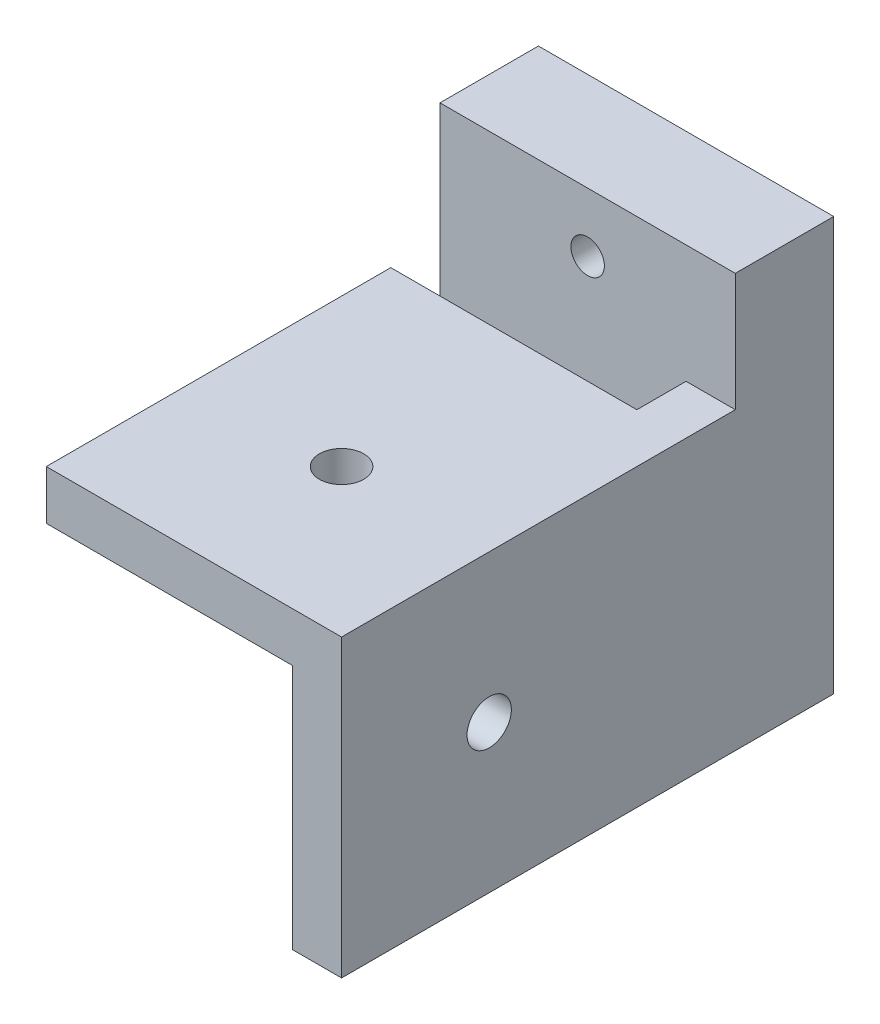
ISO-10303-21;
HEADER;
FILE_DESCRIPTION(('STEP AP214'),'2;1');
FILE_NAME('part.step','',(''),(''),'','','');
FILE_SCHEMA(('AUTOMOTIVE_DESIGN { 1 0 10303 214 1 1 1 1 }'));
ENDSEC;
DATA;
#1=APPLICATION_CONTEXT('core data for automotive mechanical design processes');
#2=APPLICATION_PROTOCOL_DEFINITION('international standard','automotive_design',2000,#1);
#3=PRODUCT_CONTEXT('',#1,'mechanical');
#4=PRODUCT('Part','Part','',(#3));
#5=PRODUCT_RELATED_PRODUCT_CATEGORY('part','',(#4));
#6=PRODUCT_DEFINITION_FORMATION('','',#4);
#7=PRODUCT_DEFINITION_CONTEXT('part definition',#1,'design');
#8=PRODUCT_DEFINITION('design','',#6,#7);
#9=PRODUCT_DEFINITION_SHAPE('','',#8);
#10=(LENGTH_UNIT() NAMED_UNIT(*) SI_UNIT(.MILLI.,.METRE.));
#11=(NAMED_UNIT(*) PLANE_ANGLE_UNIT() SI_UNIT($,.RADIAN.));
#12=(NAMED_UNIT(*) SI_UNIT($,.STERADIAN.) SOLID_ANGLE_UNIT());
#13=UNCERTAINTY_MEASURE_WITH_UNIT(LENGTH_MEASURE(1.E-05),#10,'distance_accuracy_value','');
#14=(GEOMETRIC_REPRESENTATION_CONTEXT(3) GLOBAL_UNCERTAINTY_ASSIGNED_CONTEXT((#13)) GLOBAL_UNIT_ASSIGNED_CONTEXT((#10,
#11,#12)) REPRESENTATION_CONTEXT('',''));
#15=CARTESIAN_POINT('',(0.,0.,0.));
#16=DIRECTION('',(0.,0.,1.));
#17=DIRECTION('',(1.,0.,0.));
#18=AXIS2_PLACEMENT_3D('',#15,#16,#17);
#19=CARTESIAN_POINT('',(0.,30.,50.));
#20=DIRECTION('',(0.,-1.,0.));
#21=DIRECTION('',(1.,0.,0.));
#22=AXIS2_PLACEMENT_3D('',#19,#20,#21);
#23=PLANE('',#22);
#24=CARTESIAN_POINT('',(-15.,30.,35.));
#25=DIRECTION('',(0.,-1.,0.));
#26=DIRECTION('',(0.,0.,-1.));
#27=AXIS2_PLACEMENT_3D('',#24,#25,#26);
#28=CIRCLE('',#27,2.25);
#29=CARTESIAN_POINT('',(-15.,30.,32.75));
#30=VERTEX_POINT('',#29);
#31=EDGE_CURVE('E190',#30,#30,#28,.T.);
#32=ORIENTED_EDGE('',*,*,#31,.T.);
#33=EDGE_LOOP('',(#32));
#34=FACE_BOUND('',#33,.T.);
#35=DIRECTION('',(1.,0.,0.));
#36=VECTOR('',#35,1.);
#37=CARTESIAN_POINT('',(-30.,30.,10.));
#38=LINE('',#37,#36);
#39=CARTESIAN_POINT('',(-5.,30.,10.));
#40=VERTEX_POINT('',#39);
#41=CARTESIAN_POINT('',(0.,30.,10.));
#42=VERTEX_POINT('',#41);
#43=EDGE_CURVE('E11',#40,#42,#38,.T.);
#44=ORIENTED_EDGE('',*,*,#43,.F.);
#45=DIRECTION('',(0.,0.,-1.));
#46=VECTOR('',#45,1.);
#47=CARTESIAN_POINT('',(-5.,30.,10.));
#48=LINE('',#47,#46);
#49=CARTESIAN_POINT('',(-5.,30.,15.));
#50=VERTEX_POINT('',#49);
#51=EDGE_CURVE('E231',#50,#40,#48,.T.);
#52=ORIENTED_EDGE('',*,*,#51,.F.);
#53=DIRECTION('',(1.,0.,0.));
#54=VECTOR('',#53,1.);
#55=CARTESIAN_POINT('',(-30.,30.,15.));
#56=LINE('',#55,#54);
#57=CARTESIAN_POINT('',(-30.,30.,15.));
#58=VERTEX_POINT('',#57);
#59=EDGE_CURVE('E220',#58,#50,#56,.T.);
#60=ORIENTED_EDGE('',*,*,#59,.F.);
#61=DIRECTION('',(0.,0.,-1.));
#62=VECTOR('',#61,1.);
#63=CARTESIAN_POINT('',(-30.,30.,50.));
#64=LINE('',#63,#62);
#65=CARTESIAN_POINT('',(-30.,30.,50.));
#66=VERTEX_POINT('',#65);
#67=EDGE_CURVE('E280',#66,#58,#64,.T.);
#68=ORIENTED_EDGE('',*,*,#67,.F.);
#69=DIRECTION('',(-1.,0.,0.));
#70=VECTOR('',#69,1.);
#71=CARTESIAN_POINT('',(0.,30.,50.));
#72=LINE('',#71,#70);
#73=CARTESIAN_POINT('',(0.,30.,50.));
#74=VERTEX_POINT('',#73);
#75=EDGE_CURVE('E255',#74,#66,#72,.T.);
#76=ORIENTED_EDGE('',*,*,#75,.F.);
#77=DIRECTION('',(0.,0.,-1.));
#78=VECTOR('',#77,1.);
#79=CARTESIAN_POINT('',(0.,30.,50.));
#80=LINE('',#79,#78);
#81=EDGE_CURVE('E50',#74,#42,#80,.T.);
#82=ORIENTED_EDGE('',*,*,#81,.T.);
#83=EDGE_LOOP('',(#44,#52,#60,#68,#76,#82));
#84=FACE_BOUND('',#83,.T.);
#85=ADVANCED_FACE('F40',(#34,#84),#23,.F.);
#86=CARTESIAN_POINT('',(-30.,0.,50.));
#87=DIRECTION('',(1.,0.,0.));
#88=DIRECTION('',(0.,0.,-1.));
#89=AXIS2_PLACEMENT_3D('',#86,#87,#88);
#90=PLANE('',#89);
#91=DIRECTION('',(0.,0.,-1.));
#92=VECTOR('',#91,1.);
#93=CARTESIAN_POINT('',(-30.,0.,50.));
#94=LINE('',#93,#92);
#95=CARTESIAN_POINT('',(-30.,0.,10.));
#96=VERTEX_POINT('',#95);
#97=CARTESIAN_POINT('',(-30.,0.,0.));
#98=VERTEX_POINT('',#97);
#99=EDGE_CURVE('E139',#96,#98,#94,.T.);
#100=ORIENTED_EDGE('',*,*,#99,.F.);
#101=DIRECTION('',(0.,1.,0.));
#102=VECTOR('',#101,1.);
#103=CARTESIAN_POINT('',(-30.,0.,10.));
#104=LINE('',#103,#102);
#105=CARTESIAN_POINT('',(-30.,42.,10.));
#106=VERTEX_POINT('',#105);
#107=EDGE_CURVE('E133',#96,#106,#104,.T.);
#108=ORIENTED_EDGE('',*,*,#107,.T.);
#109=DIRECTION('',(0.,0.,1.));
#110=VECTOR('',#109,1.);
#111=CARTESIAN_POINT('',(-30.,42.,0.));
#112=LINE('',#111,#110);
#113=CARTESIAN_POINT('',(-30.,42.,0.));
#114=VERTEX_POINT('',#113);
#115=EDGE_CURVE('E138',#114,#106,#112,.T.);
#116=ORIENTED_EDGE('',*,*,#115,.F.);
#117=DIRECTION('',(0.,-1.,0.));
#118=VECTOR('',#117,1.);
#119=CARTESIAN_POINT('',(-30.,0.,0.));
#120=LINE('',#119,#118);
#121=EDGE_CURVE('E269',#114,#98,#120,.T.);
#122=ORIENTED_EDGE('',*,*,#121,.T.);
#123=EDGE_LOOP('',(#100,#108,#116,#122));
#124=FACE_BOUND('',#123,.T.);
#125=ADVANCED_FACE('F135',(#124),#90,.F.);
#126=CARTESIAN_POINT('',(0.,0.,50.));
#127=DIRECTION('',(-1.,0.,0.));
#128=DIRECTION('',(0.,0.,1.));
#129=AXIS2_PLACEMENT_3D('',#126,#127,#128);
#130=PLANE('',#129);
#131=CARTESIAN_POINT('',(0.,15.,35.));
#132=DIRECTION('',(-1.,0.,0.));
#133=DIRECTION('',(0.,0.,1.));
#134=AXIS2_PLACEMENT_3D('',#131,#132,#133);
#135=CIRCLE('',#134,2.25);
#136=CARTESIAN_POINT('',(0.,15.,37.25));
#137=VERTEX_POINT('',#136);
#138=EDGE_CURVE('E182',#137,#137,#135,.T.);
#139=ORIENTED_EDGE('',*,*,#138,.T.);
#140=EDGE_LOOP('',(#139));
#141=FACE_BOUND('',#140,.T.);
#142=DIRECTION('',(0.,1.,0.));
#143=VECTOR('',#142,1.);
#144=CARTESIAN_POINT('',(0.,0.,0.));
#145=LINE('',#144,#143);
#146=CARTESIAN_POINT('',(0.,0.,0.));
#147=VERTEX_POINT('',#146);
#148=CARTESIAN_POINT('',(0.,42.,0.));
#149=VERTEX_POINT('',#148);
#150=EDGE_CURVE('E144',#147,#149,#145,.T.);
#151=ORIENTED_EDGE('',*,*,#150,.T.);
#152=DIRECTION('',(0.,0.,-1.));
#153=VECTOR('',#152,1.);
#154=CARTESIAN_POINT('',(0.,42.,0.));
#155=LINE('',#154,#153);
#156=CARTESIAN_POINT('',(0.,42.,10.));
#157=VERTEX_POINT('',#156);
#158=EDGE_CURVE('E157',#157,#149,#155,.T.);
#159=ORIENTED_EDGE('',*,*,#158,.F.);
#160=DIRECTION('',(0.,-1.,0.));
#161=VECTOR('',#160,1.);
#162=CARTESIAN_POINT('',(0.,42.,10.));
#163=LINE('',#162,#161);
#164=EDGE_CURVE('E152',#157,#42,#163,.T.);
#165=ORIENTED_EDGE('',*,*,#164,.T.);
#166=ORIENTED_EDGE('',*,*,#81,.F.);
#167=DIRECTION('',(0.,1.,0.));
#168=VECTOR('',#167,1.);
#169=CARTESIAN_POINT('',(0.,0.,50.));
#170=LINE('',#169,#168);
#171=CARTESIAN_POINT('',(0.,0.,50.));
#172=VERTEX_POINT('',#171);
#173=EDGE_CURVE('E251',#172,#74,#170,.T.);
#174=ORIENTED_EDGE('',*,*,#173,.F.);
#175=DIRECTION('',(0.,0.,-1.));
#176=VECTOR('',#175,1.);
#177=CARTESIAN_POINT('',(0.,0.,50.));
#178=LINE('',#177,#176);
#179=EDGE_CURVE('E266',#172,#147,#178,.T.);
#180=ORIENTED_EDGE('',*,*,#179,.T.);
#181=EDGE_LOOP('',(#151,#159,#165,#166,#174,#180));
#182=FACE_BOUND('',#181,.T.);
#183=ADVANCED_FACE('F42',(#141,#182),#130,.F.);
#184=CARTESIAN_POINT('',(-30.,0.,25.));
#185=VERTEX_POINT('',#184);
#186=CARTESIAN_POINT('',(-30.,0.,15.));
#187=VERTEX_POINT('',#186);
#188=EDGE_CURVE('E277',#185,#187,#94,.T.);
#189=ORIENTED_EDGE('',*,*,#188,.F.);
#190=DIRECTION('',(0.,1.,0.));
#191=VECTOR('',#190,1.);
#192=CARTESIAN_POINT('',(-30.,0.,25.));
#193=LINE('',#192,#191);
#194=CARTESIAN_POINT('',(-30.,25.,25.));
#195=VERTEX_POINT('',#194);
#196=EDGE_CURVE('E221',#185,#195,#193,.T.);
#197=ORIENTED_EDGE('',*,*,#196,.T.);
#198=DIRECTION('',(0.,0.,1.));
#199=VECTOR('',#198,1.);
#200=CARTESIAN_POINT('',(-30.,25.,25.));
#201=LINE('',#200,#199);
#202=CARTESIAN_POINT('',(-30.,25.,50.));
#203=VERTEX_POINT('',#202);
#204=EDGE_CURVE('E210',#195,#203,#201,.T.);
#205=ORIENTED_EDGE('',*,*,#204,.T.);
#206=DIRECTION('',(0.,-1.,0.));
#207=VECTOR('',#206,1.);
#208=CARTESIAN_POINT('',(-30.,0.,50.));
#209=LINE('',#208,#207);
#210=EDGE_CURVE('E259',#66,#203,#209,.T.);
#211=ORIENTED_EDGE('',*,*,#210,.F.);
#212=ORIENTED_EDGE('',*,*,#67,.T.);
#213=DIRECTION('',(0.,1.,0.));
#214=VECTOR('',#213,1.);
#215=CARTESIAN_POINT('',(-30.,0.,15.));
#216=LINE('',#215,#214);
#217=EDGE_CURVE('E237',#187,#58,#216,.T.);
#218=ORIENTED_EDGE('',*,*,#217,.F.);
#219=EDGE_LOOP('',(#189,#197,#205,#211,#212,#218));
#220=FACE_BOUND('',#219,.T.);
#221=ADVANCED_FACE('F309',(#220),#90,.F.);
#222=CARTESIAN_POINT('',(0.,0.,50.));
#223=DIRECTION('',(0.,1.,0.));
#224=DIRECTION('',(-1.,0.,0.));
#225=AXIS2_PLACEMENT_3D('',#222,#223,#224);
#226=PLANE('',#225);
#227=DIRECTION('',(1.,0.,0.));
#228=VECTOR('',#227,1.);
#229=CARTESIAN_POINT('',(0.,0.,50.));
#230=LINE('',#229,#228);
#231=CARTESIAN_POINT('',(-5.,0.,50.));
#232=VERTEX_POINT('',#231);
#233=EDGE_CURVE('E263',#232,#172,#230,.T.);
#234=ORIENTED_EDGE('',*,*,#233,.F.);
#235=DIRECTION('',(0.,0.,-1.));
#236=VECTOR('',#235,1.);
#237=CARTESIAN_POINT('',(-5.,0.,25.));
#238=LINE('',#237,#236);
#239=CARTESIAN_POINT('',(-5.,0.,25.));
#240=VERTEX_POINT('',#239);
#241=EDGE_CURVE('E194',#232,#240,#238,.T.);
#242=ORIENTED_EDGE('',*,*,#241,.T.);
#243=DIRECTION('',(-1.,0.,0.));
#244=VECTOR('',#243,1.);
#245=CARTESIAN_POINT('',(-5.,0.,25.));
#246=LINE('',#245,#244);
#247=EDGE_CURVE('E198',#240,#185,#246,.T.);
#248=ORIENTED_EDGE('',*,*,#247,.T.);
#249=ORIENTED_EDGE('',*,*,#188,.T.);
#250=DIRECTION('',(1.,0.,0.));
#251=VECTOR('',#250,1.);
#252=CARTESIAN_POINT('',(-30.,0.,15.));
#253=LINE('',#252,#251);
#254=CARTESIAN_POINT('',(-5.,0.,15.));
#255=VERTEX_POINT('',#254);
#256=EDGE_CURVE('E227',#187,#255,#253,.T.);
#257=ORIENTED_EDGE('',*,*,#256,.T.);
#258=DIRECTION('',(0.,0.,-1.));
#259=VECTOR('',#258,1.);
#260=CARTESIAN_POINT('',(-5.,0.,10.));
#261=LINE('',#260,#259);
#262=CARTESIAN_POINT('',(-5.,0.,10.));
#263=VERTEX_POINT('',#262);
#264=EDGE_CURVE('E66',#255,#263,#261,.T.);
#265=ORIENTED_EDGE('',*,*,#264,.T.);
#266=DIRECTION('',(-1.,0.,0.));
#267=VECTOR('',#266,1.);
#268=CARTESIAN_POINT('',(-30.,0.,10.));
#269=LINE('',#268,#267);
#270=EDGE_CURVE('E234',#263,#96,#269,.T.);
#271=ORIENTED_EDGE('',*,*,#270,.T.);
#272=ORIENTED_EDGE('',*,*,#99,.T.);
#273=DIRECTION('',(1.,0.,0.));
#274=VECTOR('',#273,1.);
#275=CARTESIAN_POINT('',(0.,0.,0.));
#276=LINE('',#275,#274);
#277=EDGE_CURVE('E256',#98,#147,#276,.T.);
#278=ORIENTED_EDGE('',*,*,#277,.T.);
#279=ORIENTED_EDGE('',*,*,#179,.F.);
#280=EDGE_LOOP('',(#234,#242,#248,#249,#257,#265,#271,#272,#278,#279));
#281=FACE_BOUND('',#280,.T.);
#282=ADVANCED_FACE('F298',(#281),#226,.F.);
#283=CARTESIAN_POINT('',(0.,0.,50.));
#284=DIRECTION('',(0.,0.,1.));
#285=DIRECTION('',(1.,0.,0.));
#286=AXIS2_PLACEMENT_3D('',#283,#284,#285);
#287=PLANE('',#286);
#288=DIRECTION('',(0.,1.,0.));
#289=VECTOR('',#288,1.);
#290=CARTESIAN_POINT('',(-5.,0.,50.));
#291=LINE('',#290,#289);
#292=CARTESIAN_POINT('',(-5.,25.,50.));
#293=VERTEX_POINT('',#292);
#294=EDGE_CURVE('E217',#232,#293,#291,.T.);
#295=ORIENTED_EDGE('',*,*,#294,.F.);
#296=ORIENTED_EDGE('',*,*,#233,.T.);
#297=ORIENTED_EDGE('',*,*,#173,.T.);
#298=ORIENTED_EDGE('',*,*,#75,.T.);
#299=ORIENTED_EDGE('',*,*,#210,.T.);
#300=DIRECTION('',(1.,0.,0.));
#301=VECTOR('',#300,1.);
#302=CARTESIAN_POINT('',(-5.,25.,50.));
#303=LINE('',#302,#301);
#304=EDGE_CURVE('E199',#203,#293,#303,.T.);
#305=ORIENTED_EDGE('',*,*,#304,.T.);
#306=EDGE_LOOP('',(#295,#296,#297,#298,#299,#305));
#307=FACE_BOUND('',#306,.T.);
#308=ADVANCED_FACE('F301',(#307),#287,.T.);
#309=CARTESIAN_POINT('',(0.,0.,0.));
#310=DIRECTION('',(0.,0.,1.));
#311=DIRECTION('',(1.,0.,0.));
#312=AXIS2_PLACEMENT_3D('',#309,#310,#311);
#313=PLANE('',#312);
#314=CARTESIAN_POINT('',(-15.,36.,0.));
#315=DIRECTION('',(0.,0.,-1.));
#316=DIRECTION('',(-1.,0.,0.));
#317=AXIS2_PLACEMENT_3D('',#314,#315,#316);
#318=CIRCLE('',#317,3.5);
#319=CARTESIAN_POINT('',(-18.5,36.,0.));
#320=VERTEX_POINT('',#319);
#321=EDGE_CURVE('E387',#320,#320,#318,.T.);
#322=ORIENTED_EDGE('',*,*,#321,.F.);
#323=EDGE_LOOP('',(#322));
#324=FACE_BOUND('',#323,.T.);
#325=ORIENTED_EDGE('',*,*,#150,.F.);
#326=ORIENTED_EDGE('',*,*,#277,.F.);
#327=ORIENTED_EDGE('',*,*,#121,.F.);
#328=DIRECTION('',(-1.,0.,0.));
#329=VECTOR('',#328,1.);
#330=CARTESIAN_POINT('',(-30.,42.,0.));
#331=LINE('',#330,#329);
#332=EDGE_CURVE('E162',#149,#114,#331,.T.);
#333=ORIENTED_EDGE('',*,*,#332,.F.);
#334=EDGE_LOOP('',(#325,#326,#327,#333));
#335=FACE_BOUND('',#334,.T.);
#336=ADVANCED_FACE('F293',(#324,#335),#313,.F.);
#337=CARTESIAN_POINT('',(-30.,0.,10.));
#338=DIRECTION('',(0.,0.,-1.));
#339=DIRECTION('',(-1.,0.,0.));
#340=AXIS2_PLACEMENT_3D('',#337,#338,#339);
#341=PLANE('',#340);
#342=CARTESIAN_POINT('',(-15.,36.,10.));
#343=DIRECTION('',(0.,0.,-1.));
#344=DIRECTION('',(-1.,0.,0.));
#345=AXIS2_PLACEMENT_3D('',#342,#343,#344);
#346=CIRCLE('',#345,1.7);
#347=CARTESIAN_POINT('',(-16.7,36.,10.));
#348=VERTEX_POINT('',#347);
#349=EDGE_CURVE('E44',#348,#348,#346,.T.);
#350=ORIENTED_EDGE('',*,*,#349,.T.);
#351=EDGE_LOOP('',(#350));
#352=FACE_BOUND('',#351,.T.);
#353=DIRECTION('',(0.,1.,0.));
#354=VECTOR('',#353,1.);
#355=CARTESIAN_POINT('',(-5.,0.,10.));
#356=LINE('',#355,#354);
#357=EDGE_CURVE('E145',#263,#40,#356,.T.);
#358=ORIENTED_EDGE('',*,*,#357,.T.);
#359=ORIENTED_EDGE('',*,*,#43,.T.);
#360=ORIENTED_EDGE('',*,*,#164,.F.);
#361=DIRECTION('',(1.,0.,0.));
#362=VECTOR('',#361,1.);
#363=CARTESIAN_POINT('',(-30.,42.,10.));
#364=LINE('',#363,#362);
#365=EDGE_CURVE('E148',#106,#157,#364,.T.);
#366=ORIENTED_EDGE('',*,*,#365,.F.);
#367=ORIENTED_EDGE('',*,*,#107,.F.);
#368=ORIENTED_EDGE('',*,*,#270,.F.);
#369=EDGE_LOOP('',(#358,#359,#360,#366,#367,#368));
#370=FACE_BOUND('',#369,.T.);
#371=ADVANCED_FACE('F150',(#352,#370),#341,.F.);
#372=CARTESIAN_POINT('',(-5.,0.,10.));
#373=DIRECTION('',(1.,0.,0.));
#374=DIRECTION('',(0.,0.,-1.));
#375=AXIS2_PLACEMENT_3D('',#372,#373,#374);
#376=PLANE('',#375);
#377=ORIENTED_EDGE('',*,*,#51,.T.);
#378=ORIENTED_EDGE('',*,*,#357,.F.);
#379=ORIENTED_EDGE('',*,*,#264,.F.);
#380=DIRECTION('',(0.,1.,0.));
#381=VECTOR('',#380,1.);
#382=CARTESIAN_POINT('',(-5.,0.,15.));
#383=LINE('',#382,#381);
#384=EDGE_CURVE('E246',#255,#50,#383,.T.);
#385=ORIENTED_EDGE('',*,*,#384,.T.);
#386=EDGE_LOOP('',(#377,#378,#379,#385));
#387=FACE_BOUND('',#386,.T.);
#388=ADVANCED_FACE('F316',(#387),#376,.F.);
#389=CARTESIAN_POINT('',(-30.,0.,15.));
#390=DIRECTION('',(0.,0.,1.));
#391=DIRECTION('',(1.,0.,0.));
#392=AXIS2_PLACEMENT_3D('',#389,#390,#391);
#393=PLANE('',#392);
#394=ORIENTED_EDGE('',*,*,#59,.T.);
#395=ORIENTED_EDGE('',*,*,#384,.F.);
#396=ORIENTED_EDGE('',*,*,#256,.F.);
#397=ORIENTED_EDGE('',*,*,#217,.T.);
#398=EDGE_LOOP('',(#394,#395,#396,#397));
#399=FACE_BOUND('',#398,.T.);
#400=ADVANCED_FACE('F314',(#399),#393,.F.);
#401=CARTESIAN_POINT('',(-5.,0.,25.));
#402=DIRECTION('',(1.,0.,0.));
#403=DIRECTION('',(0.,0.,-1.));
#404=AXIS2_PLACEMENT_3D('',#401,#402,#403);
#405=PLANE('',#404);
#406=CARTESIAN_POINT('',(-5.,15.,35.));
#407=DIRECTION('',(-1.,0.,0.));
#408=DIRECTION('',(0.,0.,1.));
#409=AXIS2_PLACEMENT_3D('',#406,#407,#408);
#410=CIRCLE('',#409,2.24999999999999);
#411=CARTESIAN_POINT('',(-5.,15.,37.25));
#412=VERTEX_POINT('',#411);
#413=EDGE_CURVE('E178',#412,#412,#410,.T.);
#414=ORIENTED_EDGE('',*,*,#413,.F.);
#415=EDGE_LOOP('',(#414));
#416=FACE_BOUND('',#415,.T.);
#417=DIRECTION('',(0.,0.,-1.));
#418=VECTOR('',#417,1.);
#419=CARTESIAN_POINT('',(-5.,25.,25.));
#420=LINE('',#419,#418);
#421=CARTESIAN_POINT('',(-5.,25.,25.));
#422=VERTEX_POINT('',#421);
#423=EDGE_CURVE('E58',#293,#422,#420,.T.);
#424=ORIENTED_EDGE('',*,*,#423,.T.);
#425=DIRECTION('',(0.,1.,0.));
#426=VECTOR('',#425,1.);
#427=CARTESIAN_POINT('',(-5.,0.,25.));
#428=LINE('',#427,#426);
#429=EDGE_CURVE('E203',#240,#422,#428,.T.);
#430=ORIENTED_EDGE('',*,*,#429,.F.);
#431=ORIENTED_EDGE('',*,*,#241,.F.);
#432=ORIENTED_EDGE('',*,*,#294,.T.);
#433=EDGE_LOOP('',(#424,#430,#431,#432));
#434=FACE_BOUND('',#433,.T.);
#435=ADVANCED_FACE('F305',(#416,#434),#405,.F.);
#436=CARTESIAN_POINT('',(-5.,0.,25.));
#437=DIRECTION('',(0.,0.,-1.));
#438=DIRECTION('',(-1.,0.,0.));
#439=AXIS2_PLACEMENT_3D('',#436,#437,#438);
#440=PLANE('',#439);
#441=DIRECTION('',(-1.,0.,0.));
#442=VECTOR('',#441,1.);
#443=CARTESIAN_POINT('',(-5.,25.,25.));
#444=LINE('',#443,#442);
#445=EDGE_CURVE('E206',#422,#195,#444,.T.);
#446=ORIENTED_EDGE('',*,*,#445,.T.);
#447=ORIENTED_EDGE('',*,*,#196,.F.);
#448=ORIENTED_EDGE('',*,*,#247,.F.);
#449=ORIENTED_EDGE('',*,*,#429,.T.);
#450=EDGE_LOOP('',(#446,#447,#448,#449));
#451=FACE_BOUND('',#450,.T.);
#452=ADVANCED_FACE('F307',(#451),#440,.F.);
#453=CARTESIAN_POINT('',(0.,25.,0.));
#454=DIRECTION('',(0.,-1.,0.));
#455=DIRECTION('',(0.,0.,-1.));
#456=AXIS2_PLACEMENT_3D('',#453,#454,#455);
#457=PLANE('',#456);
#458=CARTESIAN_POINT('',(-15.,25.,35.));
#459=DIRECTION('',(0.,-1.,0.));
#460=DIRECTION('',(0.,0.,-1.));
#461=AXIS2_PLACEMENT_3D('',#458,#459,#460);
#462=CIRCLE('',#461,2.24999999999999);
#463=CARTESIAN_POINT('',(-15.,25.,32.75));
#464=VERTEX_POINT('',#463);
#465=EDGE_CURVE('E186',#464,#464,#462,.T.);
#466=ORIENTED_EDGE('',*,*,#465,.F.);
#467=EDGE_LOOP('',(#466));
#468=FACE_BOUND('',#467,.T.);
#469=ORIENTED_EDGE('',*,*,#423,.F.);
#470=ORIENTED_EDGE('',*,*,#304,.F.);
#471=ORIENTED_EDGE('',*,*,#204,.F.);
#472=ORIENTED_EDGE('',*,*,#445,.F.);
#473=EDGE_LOOP('',(#469,#470,#471,#472));
#474=FACE_BOUND('',#473,.T.);
#475=ADVANCED_FACE('F317',(#468,#474),#457,.T.);
#476=CARTESIAN_POINT('',(-15.,25.,35.));
#477=DIRECTION('',(0.,-1.,0.));
#478=DIRECTION('',(0.,0.,-1.));
#479=AXIS2_PLACEMENT_3D('',#476,#477,#478);
#480=CYLINDRICAL_SURFACE('',#479,2.24999999999999);
#481=ORIENTED_EDGE('',*,*,#31,.F.);
#482=EDGE_LOOP('',(#481));
#483=FACE_BOUND('',#482,.T.);
#484=ORIENTED_EDGE('',*,*,#465,.T.);
#485=EDGE_LOOP('',(#484));
#486=FACE_BOUND('',#485,.T.);
#487=ADVANCED_FACE('F319',(#483,#486),#480,.F.);
#488=CARTESIAN_POINT('',(-5.,15.,35.));
#489=DIRECTION('',(-1.,0.,0.));
#490=DIRECTION('',(0.,0.,1.));
#491=AXIS2_PLACEMENT_3D('',#488,#489,#490);
#492=CYLINDRICAL_SURFACE('',#491,2.24999999999999);
#493=ORIENTED_EDGE('',*,*,#138,.F.);
#494=EDGE_LOOP('',(#493));
#495=FACE_BOUND('',#494,.T.);
#496=ORIENTED_EDGE('',*,*,#413,.T.);
#497=EDGE_LOOP('',(#496));
#498=FACE_BOUND('',#497,.T.);
#499=ADVANCED_FACE('F326',(#495,#498),#492,.F.);
#500=CARTESIAN_POINT('',(0.,42.,0.));
#501=DIRECTION('',(0.,1.,0.));
#502=DIRECTION('',(-1.,0.,0.));
#503=AXIS2_PLACEMENT_3D('',#500,#501,#502);
#504=PLANE('',#503);
#505=ORIENTED_EDGE('',*,*,#115,.T.);
#506=ORIENTED_EDGE('',*,*,#365,.T.);
#507=ORIENTED_EDGE('',*,*,#158,.T.);
#508=ORIENTED_EDGE('',*,*,#332,.T.);
#509=EDGE_LOOP('',(#505,#506,#507,#508));
#510=FACE_BOUND('',#509,.T.);
#511=ADVANCED_FACE('F160',(#510),#504,.T.);
#512=CARTESIAN_POINT('',(-15.,36.,0.));
#513=DIRECTION('',(0.,0.,-1.));
#514=DIRECTION('',(-1.,0.,0.));
#515=AXIS2_PLACEMENT_3D('',#512,#513,#514);
#516=CYLINDRICAL_SURFACE('',#515,1.7);
#517=CARTESIAN_POINT('',(-15.,36.,2.4));
#518=DIRECTION('',(0.,0.,-1.));
#519=DIRECTION('',(-1.,0.,0.));
#520=AXIS2_PLACEMENT_3D('',#517,#518,#519);
#521=CIRCLE('',#520,1.70000000000001);
#522=CARTESIAN_POINT('',(-16.7,36.,2.4));
#523=VERTEX_POINT('',#522);
#524=EDGE_CURVE('E168',#523,#523,#521,.T.);
#525=ORIENTED_EDGE('',*,*,#524,.T.);
#526=EDGE_LOOP('',(#525));
#527=FACE_BOUND('',#526,.T.);
#528=ORIENTED_EDGE('',*,*,#349,.F.);
#529=EDGE_LOOP('',(#528));
#530=FACE_BOUND('',#529,.T.);
#531=ADVANCED_FACE('F365',(#527,#530),#516,.F.);
#532=CARTESIAN_POINT('',(-13.3,36.,2.4));
#533=DIRECTION('',(0.,0.,1.));
#534=DIRECTION('',(1.,0.,0.));
#535=AXIS2_PLACEMENT_3D('',#532,#533,#534);
#536=PLANE('',#535);
#537=ORIENTED_EDGE('',*,*,#524,.F.);
#538=EDGE_LOOP('',(#537));
#539=FACE_BOUND('',#538,.T.);
#540=CARTESIAN_POINT('',(-15.,36.,2.4));
#541=DIRECTION('',(0.,0.,-1.));
#542=DIRECTION('',(-1.,0.,0.));
#543=AXIS2_PLACEMENT_3D('',#540,#541,#542);
#544=CIRCLE('',#543,3.49999999999999);
#545=CARTESIAN_POINT('',(-18.5,36.,2.4));
#546=VERTEX_POINT('',#545);
#547=EDGE_CURVE('E384',#546,#546,#544,.T.);
#548=ORIENTED_EDGE('',*,*,#547,.T.);
#549=EDGE_LOOP('',(#548));
#550=FACE_BOUND('',#549,.T.);
#551=ADVANCED_FACE('F371',(#539,#550),#536,.F.);
#552=CARTESIAN_POINT('',(-15.,36.,0.));
#553=DIRECTION('',(0.,0.,-1.));
#554=DIRECTION('',(-1.,0.,0.));
#555=AXIS2_PLACEMENT_3D('',#552,#553,#554);
#556=CYLINDRICAL_SURFACE('',#555,3.5);
#557=ORIENTED_EDGE('',*,*,#547,.F.);
#558=EDGE_LOOP('',(#557));
#559=FACE_BOUND('',#558,.T.);
#560=ORIENTED_EDGE('',*,*,#321,.T.);
#561=EDGE_LOOP('',(#560));
#562=FACE_BOUND('',#561,.T.);
#563=ADVANCED_FACE('F375',(#559,#562),#556,.F.);
#564=CLOSED_SHELL('',(#85,#125,#183,#221,#282,#308,#336,#371,#388,#400,#435,#452,#475,#487,#499,
#511,#531,#551,#563));
#565=MANIFOLD_SOLID_BREP('B2',#564);
#566=ADVANCED_BREP_SHAPE_REPRESENTATION('',(#18,#565),#14);
#567=SHAPE_DEFINITION_REPRESENTATION(#9,#566);
ENDSEC;
END-ISO-10303-21;
